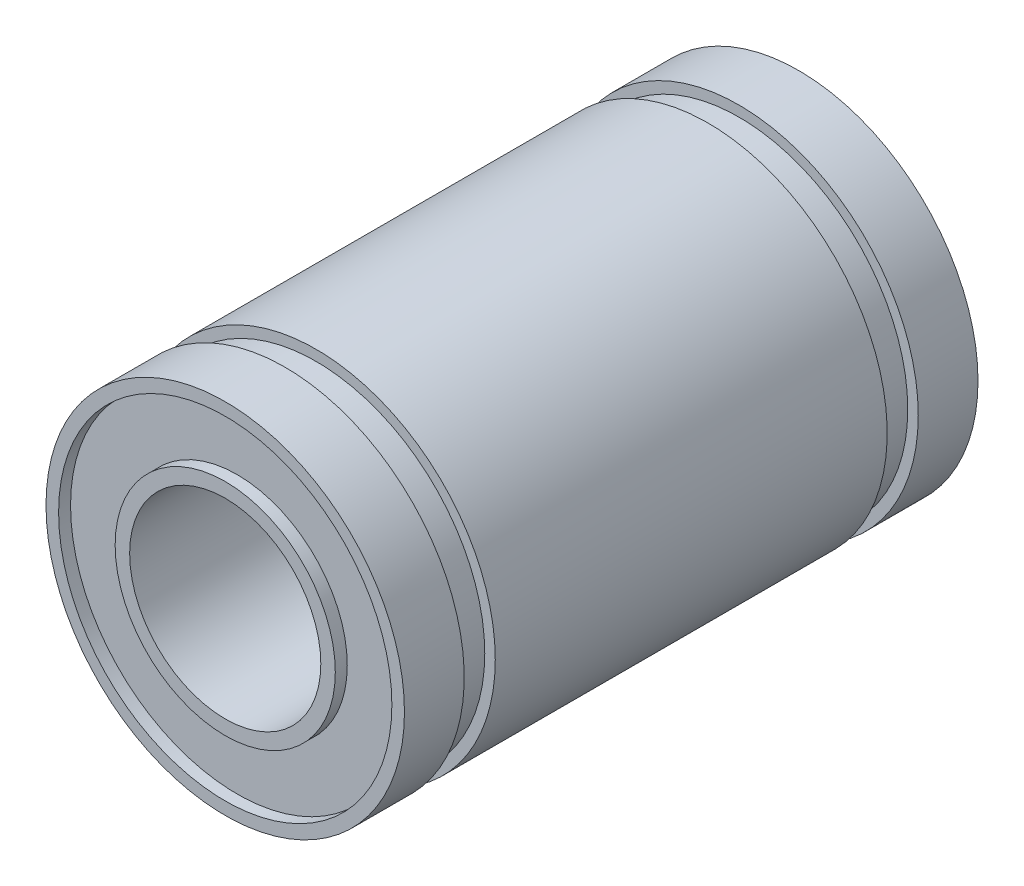
ISO-10303-21;
HEADER;
FILE_DESCRIPTION(('STEP AP214'),'2;1');
FILE_NAME('part.step','',(''),(''),'','','');
FILE_SCHEMA(('AUTOMOTIVE_DESIGN { 1 0 10303 214 1 1 1 1 }'));
ENDSEC;
DATA;
#1=APPLICATION_CONTEXT('core data for automotive mechanical design processes');
#2=APPLICATION_PROTOCOL_DEFINITION('international standard','automotive_design',2000,#1);
#3=PRODUCT_CONTEXT('',#1,'mechanical');
#4=PRODUCT('Part','Part','',(#3));
#5=PRODUCT_RELATED_PRODUCT_CATEGORY('part','',(#4));
#6=PRODUCT_DEFINITION_FORMATION('','',#4);
#7=PRODUCT_DEFINITION_CONTEXT('part definition',#1,'design');
#8=PRODUCT_DEFINITION('design','',#6,#7);
#9=PRODUCT_DEFINITION_SHAPE('','',#8);
#10=(LENGTH_UNIT() NAMED_UNIT(*) SI_UNIT(.MILLI.,.METRE.));
#11=(NAMED_UNIT(*) PLANE_ANGLE_UNIT() SI_UNIT($,.RADIAN.));
#12=(NAMED_UNIT(*) SI_UNIT($,.STERADIAN.) SOLID_ANGLE_UNIT());
#13=UNCERTAINTY_MEASURE_WITH_UNIT(LENGTH_MEASURE(1.E-05),#10,'distance_accuracy_value','');
#14=(GEOMETRIC_REPRESENTATION_CONTEXT(3) GLOBAL_UNCERTAINTY_ASSIGNED_CONTEXT((#13)) GLOBAL_UNIT_ASSIGNED_CONTEXT((#10,
#11,#12)) REPRESENTATION_CONTEXT('',''));
#15=CARTESIAN_POINT('',(0.,0.,0.));
#16=DIRECTION('',(0.,0.,1.));
#17=DIRECTION('',(1.,0.,0.));
#18=AXIS2_PLACEMENT_3D('',#15,#16,#17);
#19=CARTESIAN_POINT('',(0.,0.,12.));
#20=DIRECTION('',(0.,0.,1.));
#21=DIRECTION('',(1.,0.,0.));
#22=AXIS2_PLACEMENT_3D('',#19,#20,#21);
#23=PLANE('',#22);
#24=CARTESIAN_POINT('',(0.,0.,12.));
#25=DIRECTION('',(0.,0.,1.));
#26=DIRECTION('',(1.,0.,0.));
#27=AXIS2_PLACEMENT_3D('',#24,#25,#26);
#28=CIRCLE('',#27,4.);
#29=CARTESIAN_POINT('',(4.,0.,12.));
#30=VERTEX_POINT('',#29);
#31=EDGE_CURVE('E57',#30,#30,#28,.T.);
#32=ORIENTED_EDGE('',*,*,#31,.F.);
#33=EDGE_LOOP('',(#32));
#34=FACE_BOUND('',#33,.T.);
#35=CARTESIAN_POINT('',(0.,0.,12.));
#36=DIRECTION('',(0.,0.,-1.));
#37=DIRECTION('',(-1.,0.,0.));
#38=AXIS2_PLACEMENT_3D('',#35,#36,#37);
#39=CIRCLE('',#38,4.60638309141382);
#40=CARTESIAN_POINT('',(-4.60638309141382,0.,12.));
#41=VERTEX_POINT('',#40);
#42=EDGE_CURVE('E138',#41,#41,#39,.T.);
#43=ORIENTED_EDGE('',*,*,#42,.F.);
#44=EDGE_LOOP('',(#43));
#45=FACE_BOUND('',#44,.T.);
#46=ADVANCED_FACE('F44',(#34,#45),#23,.T.);
#47=CARTESIAN_POINT('',(0.,0.,-12.));
#48=DIRECTION('',(0.,0.,1.));
#49=DIRECTION('',(1.,0.,0.));
#50=AXIS2_PLACEMENT_3D('',#47,#48,#49);
#51=PLANE('',#50);
#52=CARTESIAN_POINT('',(0.,0.,-12.));
#53=DIRECTION('',(0.,0.,1.));
#54=DIRECTION('',(1.,0.,0.));
#55=AXIS2_PLACEMENT_3D('',#52,#53,#54);
#56=CIRCLE('',#55,4.);
#57=CARTESIAN_POINT('',(4.,0.,-12.));
#58=VERTEX_POINT('',#57);
#59=EDGE_CURVE('E60',#58,#58,#56,.T.);
#60=ORIENTED_EDGE('',*,*,#59,.T.);
#61=EDGE_LOOP('',(#60));
#62=FACE_BOUND('',#61,.T.);
#63=CARTESIAN_POINT('',(0.,0.,-12.));
#64=DIRECTION('',(0.,0.,-1.));
#65=DIRECTION('',(-1.,0.,0.));
#66=AXIS2_PLACEMENT_3D('',#63,#64,#65);
#67=CIRCLE('',#66,4.60638309141382);
#68=CARTESIAN_POINT('',(-4.60638309141382,0.,-12.));
#69=VERTEX_POINT('',#68);
#70=EDGE_CURVE('E135',#69,#69,#67,.T.);
#71=ORIENTED_EDGE('',*,*,#70,.T.);
#72=EDGE_LOOP('',(#71));
#73=FACE_BOUND('',#72,.T.);
#74=ADVANCED_FACE('F95',(#62,#73),#51,.F.);
#75=CARTESIAN_POINT('',(0.,0.,12.));
#76=DIRECTION('',(0.,0.,-1.));
#77=DIRECTION('',(-1.,0.,0.));
#78=AXIS2_PLACEMENT_3D('',#75,#76,#77);
#79=CYLINDRICAL_SURFACE('',#78,7.5);
#80=CARTESIAN_POINT('',(0.,0.,12.));
#81=DIRECTION('',(0.,0.,1.));
#82=DIRECTION('',(1.,0.,0.));
#83=AXIS2_PLACEMENT_3D('',#80,#81,#82);
#84=CIRCLE('',#83,7.5);
#85=CARTESIAN_POINT('',(7.5,0.,12.));
#86=VERTEX_POINT('',#85);
#87=EDGE_CURVE('E12',#86,#86,#84,.T.);
#88=ORIENTED_EDGE('',*,*,#87,.F.);
#89=EDGE_LOOP('',(#88));
#90=FACE_BOUND('',#89,.T.);
#91=CARTESIAN_POINT('',(0.,0.,9.5));
#92=DIRECTION('',(0.,0.,-1.));
#93=DIRECTION('',(-1.,0.,0.));
#94=AXIS2_PLACEMENT_3D('',#91,#92,#93);
#95=CIRCLE('',#94,7.5);
#96=CARTESIAN_POINT('',(-7.5,0.,9.5));
#97=VERTEX_POINT('',#96);
#98=EDGE_CURVE('E48',#97,#97,#95,.T.);
#99=ORIENTED_EDGE('',*,*,#98,.F.);
#100=EDGE_LOOP('',(#99));
#101=FACE_BOUND('',#100,.T.);
#102=ADVANCED_FACE('F46',(#90,#101),#79,.T.);
#103=CARTESIAN_POINT('',(0.,0.,-8.2));
#104=DIRECTION('',(0.,0.,-1.));
#105=DIRECTION('',(-1.,0.,0.));
#106=AXIS2_PLACEMENT_3D('',#103,#104,#105);
#107=CIRCLE('',#106,7.5);
#108=CARTESIAN_POINT('',(-7.5,0.,-8.2));
#109=VERTEX_POINT('',#108);
#110=EDGE_CURVE('E66',#109,#109,#107,.T.);
#111=ORIENTED_EDGE('',*,*,#110,.F.);
#112=EDGE_LOOP('',(#111));
#113=FACE_BOUND('',#112,.T.);
#114=CARTESIAN_POINT('',(0.,0.,8.2));
#115=DIRECTION('',(0.,0.,1.));
#116=DIRECTION('',(1.,0.,0.));
#117=AXIS2_PLACEMENT_3D('',#114,#115,#116);
#118=CIRCLE('',#117,7.5);
#119=CARTESIAN_POINT('',(7.5,0.,8.2));
#120=VERTEX_POINT('',#119);
#121=EDGE_CURVE('E69',#120,#120,#118,.T.);
#122=ORIENTED_EDGE('',*,*,#121,.F.);
#123=EDGE_LOOP('',(#122));
#124=FACE_BOUND('',#123,.T.);
#125=ADVANCED_FACE('F125',(#113,#124),#79,.T.);
#126=CARTESIAN_POINT('',(0.,0.,-12.));
#127=DIRECTION('',(0.,0.,1.));
#128=DIRECTION('',(1.,0.,0.));
#129=AXIS2_PLACEMENT_3D('',#126,#127,#128);
#130=CIRCLE('',#129,7.5);
#131=CARTESIAN_POINT('',(7.5,0.,-12.));
#132=VERTEX_POINT('',#131);
#133=EDGE_CURVE('E52',#132,#132,#130,.T.);
#134=ORIENTED_EDGE('',*,*,#133,.T.);
#135=EDGE_LOOP('',(#134));
#136=FACE_BOUND('',#135,.T.);
#137=CARTESIAN_POINT('',(0.,0.,-9.5));
#138=DIRECTION('',(0.,0.,1.));
#139=DIRECTION('',(1.,0.,0.));
#140=AXIS2_PLACEMENT_3D('',#137,#138,#139);
#141=CIRCLE('',#140,7.5);
#142=CARTESIAN_POINT('',(7.5,0.,-9.5));
#143=VERTEX_POINT('',#142);
#144=EDGE_CURVE('E63',#143,#143,#141,.T.);
#145=ORIENTED_EDGE('',*,*,#144,.F.);
#146=EDGE_LOOP('',(#145));
#147=FACE_BOUND('',#146,.T.);
#148=ADVANCED_FACE('F120',(#136,#147),#79,.T.);
#149=CARTESIAN_POINT('',(0.,0.,12.));
#150=DIRECTION('',(0.,0.,-1.));
#151=DIRECTION('',(-1.,0.,0.));
#152=AXIS2_PLACEMENT_3D('',#149,#150,#151);
#153=CIRCLE('',#152,6.97294129068912);
#154=CARTESIAN_POINT('',(-6.97294129068912,0.,12.));
#155=VERTEX_POINT('',#154);
#156=EDGE_CURVE('E129',#155,#155,#153,.T.);
#157=ORIENTED_EDGE('',*,*,#156,.T.);
#158=EDGE_LOOP('',(#157));
#159=FACE_BOUND('',#158,.T.);
#160=ORIENTED_EDGE('',*,*,#87,.T.);
#161=EDGE_LOOP('',(#160));
#162=FACE_BOUND('',#161,.T.);
#163=ADVANCED_FACE('F110',(#159,#162),#23,.T.);
#164=CARTESIAN_POINT('',(0.,0.,-12.));
#165=DIRECTION('',(0.,0.,-1.));
#166=DIRECTION('',(-1.,0.,0.));
#167=AXIS2_PLACEMENT_3D('',#164,#165,#166);
#168=CIRCLE('',#167,6.97294129068912);
#169=CARTESIAN_POINT('',(-6.97294129068912,0.,-12.));
#170=VERTEX_POINT('',#169);
#171=EDGE_CURVE('E145',#170,#170,#168,.T.);
#172=ORIENTED_EDGE('',*,*,#171,.F.);
#173=EDGE_LOOP('',(#172));
#174=FACE_BOUND('',#173,.T.);
#175=ORIENTED_EDGE('',*,*,#133,.F.);
#176=EDGE_LOOP('',(#175));
#177=FACE_BOUND('',#176,.T.);
#178=ADVANCED_FACE('F101',(#174,#177),#51,.F.);
#179=CARTESIAN_POINT('',(0.,0.,12.));
#180=DIRECTION('',(0.,0.,-1.));
#181=DIRECTION('',(-1.,0.,0.));
#182=AXIS2_PLACEMENT_3D('',#179,#180,#181);
#183=CYLINDRICAL_SURFACE('',#182,4.);
#184=ORIENTED_EDGE('',*,*,#31,.T.);
#185=EDGE_LOOP('',(#184));
#186=FACE_BOUND('',#185,.T.);
#187=ORIENTED_EDGE('',*,*,#59,.F.);
#188=EDGE_LOOP('',(#187));
#189=FACE_BOUND('',#188,.T.);
#190=ADVANCED_FACE('F98',(#186,#189),#183,.F.);
#191=CARTESIAN_POINT('',(7.99457965207147,0.,-8.2));
#192=DIRECTION('',(0.,0.,-1.));
#193=DIRECTION('',(-1.,0.,0.));
#194=AXIS2_PLACEMENT_3D('',#191,#192,#193);
#195=PLANE('',#194);
#196=CARTESIAN_POINT('',(0.,0.,-8.2));
#197=DIRECTION('',(0.,0.,-1.));
#198=DIRECTION('',(-1.,0.,0.));
#199=AXIS2_PLACEMENT_3D('',#196,#197,#198);
#200=CIRCLE('',#199,7.06045407366765);
#201=CARTESIAN_POINT('',(-7.06045407366765,0.,-8.2));
#202=VERTEX_POINT('',#201);
#203=EDGE_CURVE('E67',#202,#202,#200,.T.);
#204=ORIENTED_EDGE('',*,*,#203,.F.);
#205=EDGE_LOOP('',(#204));
#206=FACE_BOUND('',#205,.T.);
#207=ORIENTED_EDGE('',*,*,#110,.T.);
#208=EDGE_LOOP('',(#207));
#209=FACE_BOUND('',#208,.T.);
#210=ADVANCED_FACE('F100',(#206,#209),#195,.T.);
#211=CARTESIAN_POINT('',(7.99457965207147,0.,-9.5));
#212=DIRECTION('',(0.,0.,1.));
#213=DIRECTION('',(1.,0.,0.));
#214=AXIS2_PLACEMENT_3D('',#211,#212,#213);
#215=PLANE('',#214);
#216=CARTESIAN_POINT('',(0.,0.,-9.5));
#217=DIRECTION('',(0.,0.,-1.));
#218=DIRECTION('',(-1.,0.,0.));
#219=AXIS2_PLACEMENT_3D('',#216,#217,#218);
#220=CIRCLE('',#219,7.06045407366765);
#221=CARTESIAN_POINT('',(-7.06045407366765,0.,-9.5));
#222=VERTEX_POINT('',#221);
#223=EDGE_CURVE('E75',#222,#222,#220,.T.);
#224=ORIENTED_EDGE('',*,*,#223,.T.);
#225=EDGE_LOOP('',(#224));
#226=FACE_BOUND('',#225,.T.);
#227=ORIENTED_EDGE('',*,*,#144,.T.);
#228=EDGE_LOOP('',(#227));
#229=FACE_BOUND('',#228,.T.);
#230=ADVANCED_FACE('F107',(#226,#229),#215,.T.);
#231=CARTESIAN_POINT('',(0.,0.,-13.6469701227416));
#232=DIRECTION('',(0.,0.,-1.));
#233=DIRECTION('',(-1.,0.,0.));
#234=AXIS2_PLACEMENT_3D('',#231,#232,#233);
#235=CYLINDRICAL_SURFACE('',#234,7.06045407366765);
#236=ORIENTED_EDGE('',*,*,#203,.T.);
#237=EDGE_LOOP('',(#236));
#238=FACE_BOUND('',#237,.T.);
#239=ORIENTED_EDGE('',*,*,#223,.F.);
#240=EDGE_LOOP('',(#239));
#241=FACE_BOUND('',#240,.T.);
#242=ADVANCED_FACE('F159',(#238,#241),#235,.T.);
#243=CARTESIAN_POINT('',(7.99457965207147,0.,9.5));
#244=DIRECTION('',(0.,0.,-1.));
#245=DIRECTION('',(-1.,0.,0.));
#246=AXIS2_PLACEMENT_3D('',#243,#244,#245);
#247=PLANE('',#246);
#248=CARTESIAN_POINT('',(0.,0.,9.5));
#249=DIRECTION('',(0.,0.,-1.));
#250=DIRECTION('',(-1.,0.,0.));
#251=AXIS2_PLACEMENT_3D('',#248,#249,#250);
#252=CIRCLE('',#251,7.06045407366765);
#253=CARTESIAN_POINT('',(-7.06045407366765,0.,9.5));
#254=VERTEX_POINT('',#253);
#255=EDGE_CURVE('E71',#254,#254,#252,.T.);
#256=ORIENTED_EDGE('',*,*,#255,.F.);
#257=EDGE_LOOP('',(#256));
#258=FACE_BOUND('',#257,.T.);
#259=ORIENTED_EDGE('',*,*,#98,.T.);
#260=EDGE_LOOP('',(#259));
#261=FACE_BOUND('',#260,.T.);
#262=ADVANCED_FACE('F165',(#258,#261),#247,.T.);
#263=CARTESIAN_POINT('',(7.99457965207147,0.,8.2));
#264=DIRECTION('',(0.,0.,1.));
#265=DIRECTION('',(1.,0.,0.));
#266=AXIS2_PLACEMENT_3D('',#263,#264,#265);
#267=PLANE('',#266);
#268=CARTESIAN_POINT('',(0.,0.,8.2));
#269=DIRECTION('',(0.,0.,-1.));
#270=DIRECTION('',(-1.,0.,0.));
#271=AXIS2_PLACEMENT_3D('',#268,#269,#270);
#272=CIRCLE('',#271,7.06045407366765);
#273=CARTESIAN_POINT('',(-7.06045407366765,0.,8.2));
#274=VERTEX_POINT('',#273);
#275=EDGE_CURVE('E77',#274,#274,#272,.T.);
#276=ORIENTED_EDGE('',*,*,#275,.T.);
#277=EDGE_LOOP('',(#276));
#278=FACE_BOUND('',#277,.T.);
#279=ORIENTED_EDGE('',*,*,#121,.T.);
#280=EDGE_LOOP('',(#279));
#281=FACE_BOUND('',#280,.T.);
#282=ADVANCED_FACE('F171',(#278,#281),#267,.T.);
#283=CARTESIAN_POINT('',(0.,0.,-13.6469701227416));
#284=DIRECTION('',(0.,0.,-1.));
#285=DIRECTION('',(-1.,0.,0.));
#286=AXIS2_PLACEMENT_3D('',#283,#284,#285);
#287=CYLINDRICAL_SURFACE('',#286,7.06045407366765);
#288=ORIENTED_EDGE('',*,*,#255,.T.);
#289=EDGE_LOOP('',(#288));
#290=FACE_BOUND('',#289,.T.);
#291=ORIENTED_EDGE('',*,*,#275,.F.);
#292=EDGE_LOOP('',(#291));
#293=FACE_BOUND('',#292,.T.);
#294=ADVANCED_FACE('F173',(#290,#293),#287,.T.);
#295=CARTESIAN_POINT('',(0.,0.,-11.5));
#296=DIRECTION('',(0.,0.,-1.));
#297=DIRECTION('',(-1.,0.,0.));
#298=AXIS2_PLACEMENT_3D('',#295,#296,#297);
#299=CYLINDRICAL_SURFACE('',#298,6.97294129068912);
#300=CARTESIAN_POINT('',(0.,0.,-11.5));
#301=DIRECTION('',(0.,0.,-1.));
#302=DIRECTION('',(-1.,0.,0.));
#303=AXIS2_PLACEMENT_3D('',#300,#301,#302);
#304=CIRCLE('',#303,6.97294129068912);
#305=CARTESIAN_POINT('',(-6.97294129068912,0.,-11.5));
#306=VERTEX_POINT('',#305);
#307=EDGE_CURVE('E82',#306,#306,#304,.T.);
#308=ORIENTED_EDGE('',*,*,#307,.F.);
#309=EDGE_LOOP('',(#308));
#310=FACE_BOUND('',#309,.T.);
#311=ORIENTED_EDGE('',*,*,#171,.T.);
#312=EDGE_LOOP('',(#311));
#313=FACE_BOUND('',#312,.T.);
#314=ADVANCED_FACE('F152',(#310,#313),#299,.F.);
#315=CARTESIAN_POINT('',(0.,0.,-11.5));
#316=DIRECTION('',(0.,0.,-1.));
#317=DIRECTION('',(-1.,0.,0.));
#318=AXIS2_PLACEMENT_3D('',#315,#316,#317);
#319=PLANE('',#318);
#320=CARTESIAN_POINT('',(0.,0.,-11.5));
#321=DIRECTION('',(0.,0.,-1.));
#322=DIRECTION('',(-1.,0.,0.));
#323=AXIS2_PLACEMENT_3D('',#320,#321,#322);
#324=CIRCLE('',#323,4.60638309141382);
#325=CARTESIAN_POINT('',(-4.60638309141382,0.,-11.5));
#326=VERTEX_POINT('',#325);
#327=EDGE_CURVE('E142',#326,#326,#324,.T.);
#328=ORIENTED_EDGE('',*,*,#327,.F.);
#329=EDGE_LOOP('',(#328));
#330=FACE_BOUND('',#329,.T.);
#331=ORIENTED_EDGE('',*,*,#307,.T.);
#332=EDGE_LOOP('',(#331));
#333=FACE_BOUND('',#332,.T.);
#334=ADVANCED_FACE('F181',(#330,#333),#319,.T.);
#335=CARTESIAN_POINT('',(0.,0.,-11.5));
#336=DIRECTION('',(0.,0.,-1.));
#337=DIRECTION('',(-1.,0.,0.));
#338=AXIS2_PLACEMENT_3D('',#335,#336,#337);
#339=CYLINDRICAL_SURFACE('',#338,4.60638309141382);
#340=ORIENTED_EDGE('',*,*,#327,.T.);
#341=EDGE_LOOP('',(#340));
#342=FACE_BOUND('',#341,.T.);
#343=ORIENTED_EDGE('',*,*,#70,.F.);
#344=EDGE_LOOP('',(#343));
#345=FACE_BOUND('',#344,.T.);
#346=ADVANCED_FACE('F185',(#342,#345),#339,.T.);
#347=CARTESIAN_POINT('',(0.,0.,11.5));
#348=DIRECTION('',(0.,0.,1.));
#349=DIRECTION('',(-1.,0.,0.));
#350=AXIS2_PLACEMENT_3D('',#347,#348,#349);
#351=PLANE('',#350);
#352=CARTESIAN_POINT('',(0.,0.,11.5));
#353=DIRECTION('',(0.,0.,-1.));
#354=DIRECTION('',(-1.,0.,0.));
#355=AXIS2_PLACEMENT_3D('',#352,#353,#354);
#356=CIRCLE('',#355,6.97294129068912);
#357=CARTESIAN_POINT('',(-6.97294129068912,0.,11.5));
#358=VERTEX_POINT('',#357);
#359=EDGE_CURVE('E131',#358,#358,#356,.T.);
#360=ORIENTED_EDGE('',*,*,#359,.F.);
#361=EDGE_LOOP('',(#360));
#362=FACE_BOUND('',#361,.T.);
#363=CARTESIAN_POINT('',(0.,0.,11.5));
#364=DIRECTION('',(0.,0.,-1.));
#365=DIRECTION('',(-1.,0.,0.));
#366=AXIS2_PLACEMENT_3D('',#363,#364,#365);
#367=CIRCLE('',#366,4.60638309141382);
#368=CARTESIAN_POINT('',(-4.60638309141382,0.,11.5));
#369=VERTEX_POINT('',#368);
#370=EDGE_CURVE('E132',#369,#369,#367,.T.);
#371=ORIENTED_EDGE('',*,*,#370,.T.);
#372=EDGE_LOOP('',(#371));
#373=FACE_BOUND('',#372,.T.);
#374=ADVANCED_FACE('F189',(#362,#373),#351,.T.);
#375=CARTESIAN_POINT('',(0.,0.,11.5));
#376=DIRECTION('',(0.,0.,1.));
#377=DIRECTION('',(1.,0.,0.));
#378=AXIS2_PLACEMENT_3D('',#375,#376,#377);
#379=CYLINDRICAL_SURFACE('',#378,6.97294129068912);
#380=ORIENTED_EDGE('',*,*,#359,.T.);
#381=EDGE_LOOP('',(#380));
#382=FACE_BOUND('',#381,.T.);
#383=ORIENTED_EDGE('',*,*,#156,.F.);
#384=EDGE_LOOP('',(#383));
#385=FACE_BOUND('',#384,.T.);
#386=ADVANCED_FACE('F191',(#382,#385),#379,.F.);
#387=CARTESIAN_POINT('',(0.,0.,11.5));
#388=DIRECTION('',(0.,0.,1.));
#389=DIRECTION('',(1.,0.,0.));
#390=AXIS2_PLACEMENT_3D('',#387,#388,#389);
#391=CYLINDRICAL_SURFACE('',#390,4.60638309141382);
#392=ORIENTED_EDGE('',*,*,#370,.F.);
#393=EDGE_LOOP('',(#392));
#394=FACE_BOUND('',#393,.T.);
#395=ORIENTED_EDGE('',*,*,#42,.T.);
#396=EDGE_LOOP('',(#395));
#397=FACE_BOUND('',#396,.T.);
#398=ADVANCED_FACE('F194',(#394,#397),#391,.T.);
#399=CLOSED_SHELL('',(#46,#74,#102,#125,#148,#163,#178,#190,#210,#230,#242,#262,#282,#294,#314,
#334,#346,#374,#386,#398));
#400=MANIFOLD_SOLID_BREP('B2',#399);
#401=ADVANCED_BREP_SHAPE_REPRESENTATION('',(#18,#400),#14);
#402=SHAPE_DEFINITION_REPRESENTATION(#9,#401);
ENDSEC;
END-ISO-10303-21;
